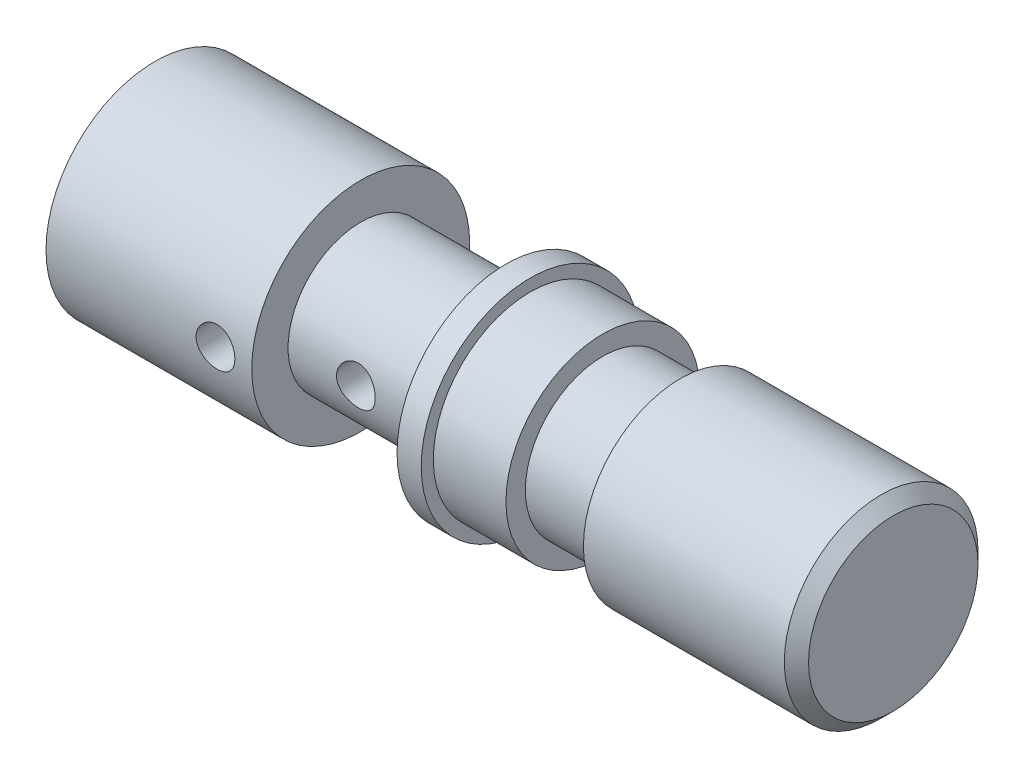
ISO-10303-21;
HEADER;
FILE_DESCRIPTION(('STEP AP214'),'2;1');
FILE_NAME('part.step','',(''),(''),'','','');
FILE_SCHEMA(('AUTOMOTIVE_DESIGN { 1 0 10303 214 1 1 1 1 }'));
ENDSEC;
DATA;
#1=APPLICATION_CONTEXT('core data for automotive mechanical design processes');
#2=APPLICATION_PROTOCOL_DEFINITION('international standard','automotive_design',2000,#1);
#3=PRODUCT_CONTEXT('',#1,'mechanical');
#4=PRODUCT('Part','Part','',(#3));
#5=PRODUCT_RELATED_PRODUCT_CATEGORY('part','',(#4));
#6=PRODUCT_DEFINITION_FORMATION('','',#4);
#7=PRODUCT_DEFINITION_CONTEXT('part definition',#1,'design');
#8=PRODUCT_DEFINITION('design','',#6,#7);
#9=PRODUCT_DEFINITION_SHAPE('','',#8);
#10=(LENGTH_UNIT() NAMED_UNIT(*) SI_UNIT(.MILLI.,.METRE.));
#11=(NAMED_UNIT(*) PLANE_ANGLE_UNIT() SI_UNIT($,.RADIAN.));
#12=(NAMED_UNIT(*) SI_UNIT($,.STERADIAN.) SOLID_ANGLE_UNIT());
#13=UNCERTAINTY_MEASURE_WITH_UNIT(LENGTH_MEASURE(1.E-05),#10,'distance_accuracy_value','');
#14=(GEOMETRIC_REPRESENTATION_CONTEXT(3) GLOBAL_UNCERTAINTY_ASSIGNED_CONTEXT((#13)) GLOBAL_UNIT_ASSIGNED_CONTEXT((#10,
#11,#12)) REPRESENTATION_CONTEXT('',''));
#15=CARTESIAN_POINT('',(0.,0.,0.));
#16=DIRECTION('',(0.,0.,1.));
#17=DIRECTION('',(1.,0.,0.));
#18=AXIS2_PLACEMENT_3D('',#15,#16,#17);
#19=CARTESIAN_POINT('',(8.5,0.,0.));
#20=DIRECTION('',(1.,0.,0.));
#21=DIRECTION('',(0.,0.,-1.));
#22=AXIS2_PLACEMENT_3D('',#19,#20,#21);
#23=CYLINDRICAL_SURFACE('',#22,3.);
#24=CARTESIAN_POINT('',(10.5,0.,3.));
#25=CARTESIAN_POINT('',(10.5000010467739,0.0441018223331418,2.99999933524065));
#26=CARTESIAN_POINT('',(10.5036590456759,0.0882148640887363,2.99901794464862));
#27=CARTESIAN_POINT('',(10.5181684922955,0.175170180541786,2.99519829448663));
#28=CARTESIAN_POINT('',(10.5290234017704,0.218011833327635,2.9923591413303));
#29=CARTESIAN_POINT('',(10.5575486667456,0.301156635618126,2.98513733301121));
#30=CARTESIAN_POINT('',(10.5752102350664,0.341462980406115,2.98075666852169));
#31=CARTESIAN_POINT('',(10.6168148970666,0.418541474557063,2.97091479660652));
#32=CARTESIAN_POINT('',(10.6407584093437,0.455313388179848,2.96545351718002));
#33=CARTESIAN_POINT('',(10.6948334065654,0.52513180149601,2.95389845960869));
#34=CARTESIAN_POINT('',(10.7250834672034,0.558084675945127,2.9477938707174));
#35=CARTESIAN_POINT('',(10.7906593932253,0.618514854642541,2.93570963871569));
#36=CARTESIAN_POINT('',(10.8259859110467,0.645991453982617,2.92973001177899));
#37=CARTESIAN_POINT('',(10.9014592939305,0.695145636973703,2.91846214986765));
#38=CARTESIAN_POINT('',(10.9416785313059,0.71671551094611,2.91318755429117));
#39=CARTESIAN_POINT('',(11.0253360444358,0.752750192307818,2.90408590923454));
#40=CARTESIAN_POINT('',(11.0687737249281,0.767216309804882,2.9002585928704));
#41=CARTESIAN_POINT('',(11.1565982151307,0.788307680905702,2.89459646334927));
#42=CARTESIAN_POINT('',(11.2009414159809,0.795102680979746,2.89271859176123));
#43=CARTESIAN_POINT('',(11.2901750733332,0.801188138824371,2.89103932417876));
#44=CARTESIAN_POINT('',(11.3350654260142,0.800479998822944,2.89123754019361));
#45=CARTESIAN_POINT('',(11.422794166149,0.791714040010485,2.89364951507618));
#46=CARTESIAN_POINT('',(11.4656548728152,0.783861624258975,2.89580694201076));
#47=CARTESIAN_POINT('',(11.5494273337827,0.761358994888816,2.90180405235812));
#48=CARTESIAN_POINT('',(11.5903389320302,0.746708237972002,2.90564387021998));
#49=CARTESIAN_POINT('',(11.6695872575234,0.710857427861002,2.91462264698391));
#50=CARTESIAN_POINT('',(11.7078897357145,0.689585364551133,2.91977577127223));
#51=CARTESIAN_POINT('',(11.7804536635406,0.641146015295118,2.93079291857236));
#52=CARTESIAN_POINT('',(11.8147143156626,0.613977568897009,2.93665708142145));
#53=CARTESIAN_POINT('',(11.8793955989819,0.553466429053675,2.94867004251873));
#54=CARTESIAN_POINT('',(11.909654527326,0.519951250913197,2.95482188595513));
#55=CARTESIAN_POINT('',(11.9641555121401,0.44824706728255,2.96654552510546));
#56=CARTESIAN_POINT('',(11.988397331481,0.410057877682036,2.97211729795427));
#57=CARTESIAN_POINT('',(12.0302471611299,0.32983930219898,2.98208728159312));
#58=CARTESIAN_POINT('',(12.0478259081794,0.287793961020715,2.98648029133423));
#59=CARTESIAN_POINT('',(12.0756188755254,0.201200917756158,2.99356017760401));
#60=CARTESIAN_POINT('',(12.0858347050896,0.156653764771329,2.996247426935));
#61=CARTESIAN_POINT('',(12.0983579507671,0.0677016332582057,2.99955663423354));
#62=CARTESIAN_POINT('',(12.1008852159403,0.0233296950565514,3.00023598988385));
#63=CARTESIAN_POINT('',(12.0985667343012,-0.0652040183604797,2.99961788676677));
#64=CARTESIAN_POINT('',(12.0937217495577,-0.109365814824845,2.99832063232137));
#65=CARTESIAN_POINT('',(12.076976621016,-0.195440979960713,2.99393214198412));
#66=CARTESIAN_POINT('',(12.0651991015209,-0.237379940811116,2.99087210618547));
#67=CARTESIAN_POINT('',(12.0350656221968,-0.318682788470423,2.98330517957641));
#68=CARTESIAN_POINT('',(12.0167089494998,-0.358046395686399,2.9787981319841));
#69=CARTESIAN_POINT('',(11.9735304451277,-0.433935389867193,2.96870264223867));
#70=CARTESIAN_POINT('',(11.9485890132808,-0.47039007538452,2.96309474642193));
#71=CARTESIAN_POINT('',(11.8930993479369,-0.538673854158812,2.95144580946015));
#72=CARTESIAN_POINT('',(11.8625500069601,-0.570502031519497,2.94540468290222));
#73=CARTESIAN_POINT('',(11.7956857690017,-0.629555697915276,2.9333589834749));
#74=CARTESIAN_POINT('',(11.7592325754399,-0.656626076999944,2.92736024574782));
#75=CARTESIAN_POINT('',(11.6821741215621,-0.704268764739795,2.91626578870035));
#76=CARTESIAN_POINT('',(11.6415690345585,-0.724841344486108,2.91117003171109));
#77=CARTESIAN_POINT('',(11.5575618771647,-0.758749646345945,2.9025170736066));
#78=CARTESIAN_POINT('',(11.5141776752508,-0.77212724902359,2.89895099369493));
#79=CARTESIAN_POINT('',(11.4256642721065,-0.791364820483173,2.89375930092876));
#80=CARTESIAN_POINT('',(11.3805355198532,-0.797226710411953,2.89213319219128));
#81=CARTESIAN_POINT('',(11.291402084851,-0.801155958613013,2.89104697818674));
#82=CARTESIAN_POINT('',(11.2474090718979,-0.799472622471941,2.89151759094413));
#83=CARTESIAN_POINT('',(11.1603585943948,-0.78893750400225,2.89440958435318));
#84=CARTESIAN_POINT('',(11.1173011057994,-0.780085906140234,2.89683091480545));
#85=CARTESIAN_POINT('',(11.0336576991484,-0.755610062798667,2.903310284285));
#86=CARTESIAN_POINT('',(10.9930552629072,-0.740038644302285,2.90735554007653));
#87=CARTESIAN_POINT('',(10.9150084677863,-0.702606218249579,2.91662727254676));
#88=CARTESIAN_POINT('',(10.8775646054798,-0.680744224098476,2.92185393448601));
#89=CARTESIAN_POINT('',(10.8057078562014,-0.630595637075257,2.93309168576127));
#90=CARTESIAN_POINT('',(10.7714165860095,-0.602138919071634,2.93912133240661));
#91=CARTESIAN_POINT('',(10.7080150193331,-0.539932214044402,2.95118201513218));
#92=CARTESIAN_POINT('',(10.6789059845325,-0.506180941743499,2.95721305119381));
#93=CARTESIAN_POINT('',(10.6260831049413,-0.433471992435474,2.96875124961583));
#94=CARTESIAN_POINT('',(10.6024979957403,-0.394418384700712,2.97424444525819));
#95=CARTESIAN_POINT('',(10.5622650336283,-0.312755456166756,2.9839352404116));
#96=CARTESIAN_POINT('',(10.5456127297346,-0.270148437878519,2.98813367073438));
#97=CARTESIAN_POINT('',(10.5218898858338,-0.189749881952397,2.99421901005387));
#98=CARTESIAN_POINT('',(10.513700246563,-0.152304806626015,2.99637108237041));
#99=CARTESIAN_POINT('',(10.5027551175332,-0.0765759181268307,2.99926179614582));
#100=CARTESIAN_POINT('',(10.49999909112,-0.0382921881619442,3.00000057718908));
#101=CARTESIAN_POINT('',(10.5,0.,3.));
#102=B_SPLINE_CURVE_WITH_KNOTS('',3,(#24,#25,#26,#27,#28,#29,#30,#31,#32,#33,#34,#35,#36,#37,
#38,#39,#40,#41,#42,#43,#44,#45,#46,#47,#48,#49,#50,#51,#52,#53,#54,#55,#56,#57,#58,#59,#60,#61,
#62,#63,#64,#65,#66,#67,#68,#69,#70,#71,#72,#73,#74,#75,#76,#77,#78,#79,#80,#81,#82,#83,#84,#85,
#86,#87,#88,#89,#90,#91,#92,#93,#94,#95,#96,#97,#98,#99,#100,#101),.UNSPECIFIED.,.T.,.F.,(4,2,2,
2,2,2,2,2,2,2,2,2,2,2,2,2,2,2,2,2,2,2,2,2,2,2,2,2,2,2,2,2,2,2,2,2,2,2,4),(0.,0.132165039579828,
0.26439369750458,0.396452221188773,0.528519546834702,0.663339591819869,0.798176979700597,
0.935330330092918,1.0724583765188,1.20648863299036,1.34049384159394,1.47076400816065,
1.60104458722842,1.73279469336265,1.86457075244718,2.00064503922595,2.13672468772705,
2.27339523838883,2.41003590873722,2.54273087007485,2.67541211567806,2.80581414254512,
2.93623030307912,3.06920114399486,3.20219827301221,3.33894598550782,3.47568799207309,
3.61162519076595,3.74752763461531,3.87897336957382,4.01041572204175,4.14084306175259,
4.27129086845139,4.40557735824494,4.53989649728917,4.67708900908297,4.8141933045401,
4.92895927593272,5.04371391182491),.UNSPECIFIED.);
#103=CARTESIAN_POINT('',(10.5,0.,3.));
#104=VERTEX_POINT('',#103);
#105=EDGE_CURVE('E80',#104,#104,#102,.T.);
#106=ORIENTED_EDGE('',*,*,#105,.T.);
#107=EDGE_LOOP('',(#106));
#108=FACE_BOUND('',#107,.T.);
#109=CARTESIAN_POINT('',(8.5,0.,0.));
#110=DIRECTION('',(1.,0.,0.));
#111=DIRECTION('',(0.,0.,-1.));
#112=AXIS2_PLACEMENT_3D('',#109,#110,#111);
#113=CIRCLE('',#112,3.);
#114=CARTESIAN_POINT('',(8.5,0.,-3.));
#115=VERTEX_POINT('',#114);
#116=EDGE_CURVE('E127',#115,#115,#113,.T.);
#117=ORIENTED_EDGE('',*,*,#116,.T.);
#118=EDGE_LOOP('',(#117));
#119=FACE_BOUND('',#118,.T.);
#120=CARTESIAN_POINT('',(14.5,0.,0.));
#121=DIRECTION('',(1.,0.,0.));
#122=DIRECTION('',(0.,0.,-1.));
#123=AXIS2_PLACEMENT_3D('',#120,#121,#122);
#124=CIRCLE('',#123,3.);
#125=CARTESIAN_POINT('',(14.5,0.,-3.));
#126=VERTEX_POINT('',#125);
#127=EDGE_CURVE('E131',#126,#126,#124,.T.);
#128=ORIENTED_EDGE('',*,*,#127,.F.);
#129=EDGE_LOOP('',(#128));
#130=FACE_BOUND('',#129,.T.);
#131=CARTESIAN_POINT('',(10.5,0.,-3.));
#132=CARTESIAN_POINT('',(10.5000010467739,-0.0441018223331418,-2.99999933524065));
#133=CARTESIAN_POINT('',(10.5036590456759,-0.0882148640887363,-2.99901794464862));
#134=CARTESIAN_POINT('',(10.5181684922955,-0.175170180541786,-2.99519829448663));
#135=CARTESIAN_POINT('',(10.5290234017704,-0.218011833327635,-2.9923591413303));
#136=CARTESIAN_POINT('',(10.5575486667456,-0.301156635618126,-2.98513733301121));
#137=CARTESIAN_POINT('',(10.5752102350664,-0.341462980406115,-2.98075666852169));
#138=CARTESIAN_POINT('',(10.6168148970666,-0.418541474557063,-2.97091479660652));
#139=CARTESIAN_POINT('',(10.6407584093437,-0.455313388179848,-2.96545351718002));
#140=CARTESIAN_POINT('',(10.6948334065654,-0.52513180149601,-2.95389845960869));
#141=CARTESIAN_POINT('',(10.7250834672034,-0.558084675945127,-2.9477938707174));
#142=CARTESIAN_POINT('',(10.7906593932253,-0.618514854642541,-2.93570963871569));
#143=CARTESIAN_POINT('',(10.8259859110467,-0.645991453982617,-2.92973001177899));
#144=CARTESIAN_POINT('',(10.9014592939305,-0.695145636973703,-2.91846214986765));
#145=CARTESIAN_POINT('',(10.9416785313059,-0.71671551094611,-2.91318755429117));
#146=CARTESIAN_POINT('',(11.0253360444358,-0.752750192307818,-2.90408590923454));
#147=CARTESIAN_POINT('',(11.0687737249281,-0.767216309804882,-2.9002585928704));
#148=CARTESIAN_POINT('',(11.1565982151307,-0.788307680905702,-2.89459646334927));
#149=CARTESIAN_POINT('',(11.2009414159809,-0.795102680979746,-2.89271859176123));
#150=CARTESIAN_POINT('',(11.2901750733332,-0.801188138824371,-2.89103932417876));
#151=CARTESIAN_POINT('',(11.3350654260142,-0.800479998822944,-2.89123754019361));
#152=CARTESIAN_POINT('',(11.422794166149,-0.791714040010485,-2.89364951507618));
#153=CARTESIAN_POINT('',(11.4656548728152,-0.783861624258975,-2.89580694201076));
#154=CARTESIAN_POINT('',(11.5494273337827,-0.761358994888816,-2.90180405235812));
#155=CARTESIAN_POINT('',(11.5903389320302,-0.746708237972002,-2.90564387021998));
#156=CARTESIAN_POINT('',(11.6695872575234,-0.710857427861002,-2.91462264698391));
#157=CARTESIAN_POINT('',(11.7078897357145,-0.689585364551133,-2.91977577127223));
#158=CARTESIAN_POINT('',(11.7804536635406,-0.641146015295118,-2.93079291857236));
#159=CARTESIAN_POINT('',(11.8147143156626,-0.613977568897009,-2.93665708142145));
#160=CARTESIAN_POINT('',(11.8793955989819,-0.553466429053675,-2.94867004251873));
#161=CARTESIAN_POINT('',(11.909654527326,-0.519951250913197,-2.95482188595513));
#162=CARTESIAN_POINT('',(11.9641555121401,-0.44824706728255,-2.96654552510546));
#163=CARTESIAN_POINT('',(11.988397331481,-0.410057877682036,-2.97211729795427));
#164=CARTESIAN_POINT('',(12.0302471611299,-0.32983930219898,-2.98208728159312));
#165=CARTESIAN_POINT('',(12.0478259081794,-0.287793961020715,-2.98648029133423));
#166=CARTESIAN_POINT('',(12.0756188755254,-0.201200917756158,-2.99356017760401));
#167=CARTESIAN_POINT('',(12.0858347050896,-0.156653764771329,-2.996247426935));
#168=CARTESIAN_POINT('',(12.0983579507671,-0.0677016332582057,-2.99955663423354));
#169=CARTESIAN_POINT('',(12.1008852159403,-0.0233296950565514,-3.00023598988385));
#170=CARTESIAN_POINT('',(12.0985667343012,0.0652040183604797,-2.99961788676677));
#171=CARTESIAN_POINT('',(12.0937217495577,0.109365814824845,-2.99832063232137));
#172=CARTESIAN_POINT('',(12.076976621016,0.195440979960713,-2.99393214198412));
#173=CARTESIAN_POINT('',(12.0651991015209,0.237379940811116,-2.99087210618547));
#174=CARTESIAN_POINT('',(12.0350656221968,0.318682788470423,-2.98330517957641));
#175=CARTESIAN_POINT('',(12.0167089494998,0.358046395686399,-2.9787981319841));
#176=CARTESIAN_POINT('',(11.9735304451277,0.433935389867193,-2.96870264223867));
#177=CARTESIAN_POINT('',(11.9485890132808,0.47039007538452,-2.96309474642193));
#178=CARTESIAN_POINT('',(11.8930993479369,0.538673854158812,-2.95144580946015));
#179=CARTESIAN_POINT('',(11.8625500069601,0.570502031519497,-2.94540468290222));
#180=CARTESIAN_POINT('',(11.7956857690017,0.629555697915276,-2.9333589834749));
#181=CARTESIAN_POINT('',(11.7592325754399,0.656626076999944,-2.92736024574782));
#182=CARTESIAN_POINT('',(11.6821741215621,0.704268764739795,-2.91626578870035));
#183=CARTESIAN_POINT('',(11.6415690345585,0.724841344486108,-2.91117003171109));
#184=CARTESIAN_POINT('',(11.5575618771647,0.758749646345945,-2.9025170736066));
#185=CARTESIAN_POINT('',(11.5141776752508,0.77212724902359,-2.89895099369493));
#186=CARTESIAN_POINT('',(11.4256642721065,0.791364820483173,-2.89375930092876));
#187=CARTESIAN_POINT('',(11.3805355198532,0.797226710411953,-2.89213319219128));
#188=CARTESIAN_POINT('',(11.291402084851,0.801155958613013,-2.89104697818674));
#189=CARTESIAN_POINT('',(11.2474090718979,0.799472622471941,-2.89151759094413));
#190=CARTESIAN_POINT('',(11.1603585943948,0.78893750400225,-2.89440958435318));
#191=CARTESIAN_POINT('',(11.1173011057994,0.780085906140234,-2.89683091480545));
#192=CARTESIAN_POINT('',(11.0336576991484,0.755610062798667,-2.903310284285));
#193=CARTESIAN_POINT('',(10.9930552629072,0.740038644302285,-2.90735554007653));
#194=CARTESIAN_POINT('',(10.9150084677863,0.702606218249579,-2.91662727254676));
#195=CARTESIAN_POINT('',(10.8775646054798,0.680744224098476,-2.92185393448601));
#196=CARTESIAN_POINT('',(10.8057078562014,0.630595637075257,-2.93309168576127));
#197=CARTESIAN_POINT('',(10.7714165860095,0.602138919071634,-2.93912133240661));
#198=CARTESIAN_POINT('',(10.7080150193331,0.539932214044402,-2.95118201513218));
#199=CARTESIAN_POINT('',(10.6789059845325,0.506180941743499,-2.95721305119381));
#200=CARTESIAN_POINT('',(10.6260831049413,0.433471992435474,-2.96875124961583));
#201=CARTESIAN_POINT('',(10.6024979957403,0.394418384700712,-2.97424444525819));
#202=CARTESIAN_POINT('',(10.5622650336283,0.312755456166756,-2.9839352404116));
#203=CARTESIAN_POINT('',(10.5456127297346,0.270148437878519,-2.98813367073438));
#204=CARTESIAN_POINT('',(10.5218898858338,0.189749881952397,-2.99421901005387));
#205=CARTESIAN_POINT('',(10.513700246563,0.152304806626015,-2.99637108237041));
#206=CARTESIAN_POINT('',(10.5027551175332,0.0765759181268307,-2.99926179614582));
#207=CARTESIAN_POINT('',(10.49999909112,0.0382921881619442,-3.00000057718908));
#208=CARTESIAN_POINT('',(10.5,0.,-3.));
#209=B_SPLINE_CURVE_WITH_KNOTS('',3,(#131,#132,#133,#134,#135,#136,#137,#138,#139,#140,#141,
#142,#143,#144,#145,#146,#147,#148,#149,#150,#151,#152,#153,#154,#155,#156,#157,#158,#159,#160,
#161,#162,#163,#164,#165,#166,#167,#168,#169,#170,#171,#172,#173,#174,#175,#176,#177,#178,#179,
#180,#181,#182,#183,#184,#185,#186,#187,#188,#189,#190,#191,#192,#193,#194,#195,#196,#197,#198,
#199,#200,#201,#202,#203,#204,#205,#206,#207,#208),.UNSPECIFIED.,.T.,.F.,(4,2,2,2,2,2,2,2,2,2,2,
2,2,2,2,2,2,2,2,2,2,2,2,2,2,2,2,2,2,2,2,2,2,2,2,2,2,2,4),(0.,0.132165039579828,0.26439369750458,
0.396452221188773,0.528519546834702,0.663339591819869,0.798176979700597,0.935330330092918,
1.0724583765188,1.20648863299036,1.34049384159394,1.47076400816065,1.60104458722842,
1.73279469336265,1.86457075244718,2.00064503922595,2.13672468772705,2.27339523838883,
2.41003590873722,2.54273087007485,2.67541211567806,2.80581414254512,2.93623030307912,
3.06920114399486,3.20219827301221,3.33894598550782,3.47568799207309,3.61162519076595,
3.74752763461531,3.87897336957382,4.01041572204175,4.14084306175259,4.27129086845139,
4.40557735824494,4.53989649728917,4.67708900908297,4.8141933045401,4.92895927593272,
5.04371391182491),.UNSPECIFIED.);
#210=CARTESIAN_POINT('',(10.5,0.,-3.));
#211=VERTEX_POINT('',#210);
#212=EDGE_CURVE('E41',#211,#211,#209,.T.);
#213=ORIENTED_EDGE('',*,*,#212,.T.);
#214=EDGE_LOOP('',(#213));
#215=FACE_BOUND('',#214,.T.);
#216=ADVANCED_FACE('F37',(#108,#119,#130,#215),#23,.T.);
#217=CARTESIAN_POINT('',(30.5,0.,0.));
#218=DIRECTION('',(-1.,0.,0.));
#219=DIRECTION('',(0.,0.,1.));
#220=AXIS2_PLACEMENT_3D('',#217,#218,#219);
#221=CYLINDRICAL_SURFACE('',#220,4.);
#222=CARTESIAN_POINT('',(15.5,0.,0.));
#223=DIRECTION('',(1.,0.,0.));
#224=DIRECTION('',(0.,0.,-1.));
#225=AXIS2_PLACEMENT_3D('',#222,#223,#224);
#226=CIRCLE('',#225,4.);
#227=CARTESIAN_POINT('',(15.5,0.,-4.));
#228=VERTEX_POINT('',#227);
#229=EDGE_CURVE('E70',#228,#228,#226,.T.);
#230=ORIENTED_EDGE('',*,*,#229,.T.);
#231=EDGE_LOOP('',(#230));
#232=FACE_BOUND('',#231,.T.);
#233=CARTESIAN_POINT('',(18.5,0.,0.));
#234=DIRECTION('',(-1.,0.,0.));
#235=DIRECTION('',(0.,0.,1.));
#236=AXIS2_PLACEMENT_3D('',#233,#234,#235);
#237=CIRCLE('',#236,4.);
#238=CARTESIAN_POINT('',(18.5,0.,4.));
#239=VERTEX_POINT('',#238);
#240=EDGE_CURVE('E144',#239,#239,#237,.T.);
#241=ORIENTED_EDGE('',*,*,#240,.T.);
#242=EDGE_LOOP('',(#241));
#243=FACE_BOUND('',#242,.T.);
#244=ADVANCED_FACE('F114',(#232,#243),#221,.T.);
#245=CARTESIAN_POINT('',(0.,0.,0.));
#246=DIRECTION('',(-1.,0.,0.));
#247=DIRECTION('',(0.,0.,1.));
#248=AXIS2_PLACEMENT_3D('',#245,#246,#247);
#249=CYLINDRICAL_SURFACE('',#248,4.5);
#250=CARTESIAN_POINT('',(0.,0.,0.));
#251=DIRECTION('',(-1.,0.,0.));
#252=DIRECTION('',(0.,0.,1.));
#253=AXIS2_PLACEMENT_3D('',#250,#251,#252);
#254=CIRCLE('',#253,4.5);
#255=CARTESIAN_POINT('',(0.,0.,4.5));
#256=VERTEX_POINT('',#255);
#257=EDGE_CURVE('E79',#256,#256,#254,.F.);
#258=ORIENTED_EDGE('',*,*,#257,.T.);
#259=EDGE_LOOP('',(#258));
#260=FACE_BOUND('',#259,.T.);
#261=CARTESIAN_POINT('',(7.79999999999999,0.,4.5));
#262=CARTESIAN_POINT('',(7.79999669285109,-0.0445302019902762,4.4999987251344));
#263=CARTESIAN_POINT('',(7.79626829303965,-0.0890912596016622,4.49933191579469));
#264=CARTESIAN_POINT('',(7.78144879324272,-0.177007998173705,4.49673340269843));
#265=CARTESIAN_POINT('',(7.77034286477667,-0.220361067906401,4.49479915155094));
#266=CARTESIAN_POINT('',(7.74111710927269,-0.304509156285261,4.48988288235168));
#267=CARTESIAN_POINT('',(7.72300639166933,-0.345307417615937,4.48690222556947));
#268=CARTESIAN_POINT('',(7.68030672701908,-0.423270679076012,4.48022037355359));
#269=CARTESIAN_POINT('',(7.65572010829142,-0.460436978455032,4.47651943741086));
#270=CARTESIAN_POINT('',(7.60047877611666,-0.530504265335136,4.46876063676479));
#271=CARTESIAN_POINT('',(7.56976700195238,-0.563359923831297,4.4646996321084));
#272=CARTESIAN_POINT('',(7.5032684987993,-0.623482447413518,4.45670189389839));
#273=CARTESIAN_POINT('',(7.46748116310341,-0.650748643409126,4.45276517527017));
#274=CARTESIAN_POINT('',(7.39153678043565,-0.699098854699203,4.44543193381378));
#275=CARTESIAN_POINT('',(7.35135074319269,-0.720137994078746,4.44203940925614));
#276=CARTESIAN_POINT('',(7.26794467859312,-0.755149496760371,4.43622206592378));
#277=CARTESIAN_POINT('',(7.22472491184272,-0.76912246622308,4.43379716414679));
#278=CARTESIAN_POINT('',(7.1369555532383,-0.789462618013184,4.43022069031475));
#279=CARTESIAN_POINT('',(7.09242453633102,-0.795907619183619,4.42905609946288));
#280=CARTESIAN_POINT('',(7.00289904214776,-0.801250298943398,4.42809279794646));
#281=CARTESIAN_POINT('',(6.95790460172938,-0.800148573190807,4.42829397948242));
#282=CARTESIAN_POINT('',(6.86928974852928,-0.790492328815567,4.43002761926745));
#283=CARTESIAN_POINT('',(6.82565938976431,-0.78202584632061,4.43154435119883));
#284=CARTESIAN_POINT('',(6.74044806531323,-0.758018717801775,4.43571355320595));
#285=CARTESIAN_POINT('',(6.69886719520686,-0.742477742197876,4.43836607619453));
#286=CARTESIAN_POINT('',(6.61867383725183,-0.704674571030506,4.44452479180617));
#287=CARTESIAN_POINT('',(6.58007880182158,-0.682376130457592,4.44803556770488));
#288=CARTESIAN_POINT('',(6.50714789701056,-0.631718577196265,4.45551176477343));
#289=CARTESIAN_POINT('',(6.47281209365784,-0.603359370570387,4.4594771929896));
#290=CARTESIAN_POINT('',(6.40886771793728,-0.540913471370295,4.46748420457096));
#291=CARTESIAN_POINT('',(6.37933178964776,-0.506752384055842,4.47152607851284));
#292=CARTESIAN_POINT('',(6.326386651499,-0.433904432458158,4.47918142153678));
#293=CARTESIAN_POINT('',(6.30298016590248,-0.395215566796148,4.48279469973826));
#294=CARTESIAN_POINT('',(6.26295045725625,-0.314323038266952,4.48919253673555));
#295=CARTESIAN_POINT('',(6.24633976044161,-0.272113055955517,4.49197556264818));
#296=CARTESIAN_POINT('',(6.22049997014189,-0.185510818303223,4.49638248688498));
#297=CARTESIAN_POINT('',(6.21125533597136,-0.141123368220269,4.49800882476965));
#298=CARTESIAN_POINT('',(6.2019409774409,-0.0643504740757385,4.4996542087596));
#299=CARTESIAN_POINT('',(6.19999760982556,-0.0321832955709817,4.50000092138312));
#300=CARTESIAN_POINT('',(6.20000330714891,0.0445302019902751,4.4999987251344));
#301=CARTESIAN_POINT('',(6.20373170696035,0.089091259601661,4.49933191579469));
#302=CARTESIAN_POINT('',(6.21855120675728,0.177007998173704,4.49673340269843));
#303=CARTESIAN_POINT('',(6.22965713522333,0.2203610679064,4.49479915155094));
#304=CARTESIAN_POINT('',(6.25888289072731,0.30450915628526,4.48988288235168));
#305=CARTESIAN_POINT('',(6.27699360833067,0.345307417615936,4.48690222556947));
#306=CARTESIAN_POINT('',(6.31969327298092,0.423270679076011,4.48022037355359));
#307=CARTESIAN_POINT('',(6.34427989170858,0.460436978455031,4.47651943741086));
#308=CARTESIAN_POINT('',(6.39952122388334,0.530504265335135,4.46876063676479));
#309=CARTESIAN_POINT('',(6.43023299804762,0.563359923831297,4.4646996321084));
#310=CARTESIAN_POINT('',(6.4967315012007,0.623482447413518,4.45670189389839));
#311=CARTESIAN_POINT('',(6.53251883689659,0.650748643409126,4.45276517527017));
#312=CARTESIAN_POINT('',(6.60846321956435,0.699098854699203,4.44543193381378));
#313=CARTESIAN_POINT('',(6.64864925680731,0.720137994078746,4.44203940925614));
#314=CARTESIAN_POINT('',(6.73205532140688,0.755149496760371,4.43622206592378));
#315=CARTESIAN_POINT('',(6.77527508815728,0.76912246622308,4.43379716414679));
#316=CARTESIAN_POINT('',(6.8630444467617,0.789462618013184,4.43022069031475));
#317=CARTESIAN_POINT('',(6.90757546366898,0.795907619183619,4.42905609946288));
#318=CARTESIAN_POINT('',(6.99710095785224,0.801250298943398,4.42809279794646));
#319=CARTESIAN_POINT('',(7.04209539827062,0.800148573190807,4.42829397948242));
#320=CARTESIAN_POINT('',(7.13071025147072,0.790492328815567,4.43002761926745));
#321=CARTESIAN_POINT('',(7.17434061023569,0.78202584632061,4.43154435119883));
#322=CARTESIAN_POINT('',(7.25955193468677,0.758018717801775,4.43571355320595));
#323=CARTESIAN_POINT('',(7.30113280479314,0.742477742197876,4.43836607619453));
#324=CARTESIAN_POINT('',(7.38132616274817,0.704674571030507,4.44452479180617));
#325=CARTESIAN_POINT('',(7.41992119817842,0.682376130457593,4.44803556770488));
#326=CARTESIAN_POINT('',(7.49285210298943,0.631718577196266,4.45551176477343));
#327=CARTESIAN_POINT('',(7.52718790634216,0.603359370570388,4.4594771929896));
#328=CARTESIAN_POINT('',(7.59113228206272,0.540913471370296,4.46748420457096));
#329=CARTESIAN_POINT('',(7.62066821035224,0.506752384055842,4.47152607851284));
#330=CARTESIAN_POINT('',(7.673613348501,0.433904432458159,4.47918142153678));
#331=CARTESIAN_POINT('',(7.69701983409752,0.395215566796148,4.48279469973826));
#332=CARTESIAN_POINT('',(7.73704954274375,0.314323038266952,4.48919253673555));
#333=CARTESIAN_POINT('',(7.75366023955839,0.272113055955518,4.49197556264818));
#334=CARTESIAN_POINT('',(7.77950002985811,0.185510818303224,4.49638248688498));
#335=CARTESIAN_POINT('',(7.78874466402864,0.141123368220271,4.49800882476965));
#336=CARTESIAN_POINT('',(7.7980590225591,0.0643504740757397,4.4996542087596));
#337=CARTESIAN_POINT('',(7.80000239017444,0.0321832955709818,4.50000092138312));
#338=CARTESIAN_POINT('',(7.79999999999999,0.,4.5));
#339=B_SPLINE_CURVE_WITH_KNOTS('',3,(#261,#262,#263,#264,#265,#266,#267,#268,#269,#270,#271,
#272,#273,#274,#275,#276,#277,#278,#279,#280,#281,#282,#283,#284,#285,#286,#287,#288,#289,#290,
#291,#292,#293,#294,#295,#296,#297,#298,#299,#300,#301,#302,#303,#304,#305,#306,#307,#308,#309,
#310,#311,#312,#313,#314,#315,#316,#317,#318,#319,#320,#321,#322,#323,#324,#325,#326,#327,#328,
#329,#330,#331,#332,#333,#334,#335,#336,#337,#338),.UNSPECIFIED.,.T.,.F.,(4,2,2,2,2,2,2,2,2,2,2,
2,2,2,2,2,2,2,2,2,2,2,2,2,2,2,2,2,2,2,2,2,2,2,2,2,2,2,4),(0.,0.133485045984415,
0.267239205636307,0.400820005305205,0.534352843278334,0.669193219956315,0.804049728380923,
0.939855667834769,1.07564995540584,1.21002771303742,1.34439486444547,1.47717756563004,
1.60996645340695,1.74348058031323,1.87699677674146,2.01237593210316,2.14781515570268,
2.28350291290744,2.41890363672683,2.51537723211183,2.64886227809625,2.78261643774814,
2.91619723741704,3.04973007539017,3.18457045206815,3.31942696049276,3.4552328999466,
3.59102718751768,3.72540494514925,3.8597720965573,3.99255479774187,4.12534368551879,
4.25885781242506,4.39237400885329,4.52775316421499,4.66319238781452,4.79888014501927,
4.93428086883866,5.03075446422367),.UNSPECIFIED.);
#340=CARTESIAN_POINT('',(7.79999999999999,0.,4.5));
#341=VERTEX_POINT('',#340);
#342=EDGE_CURVE('E159',#341,#341,#339,.T.);
#343=ORIENTED_EDGE('',*,*,#342,.T.);
#344=EDGE_LOOP('',(#343));
#345=FACE_BOUND('',#344,.T.);
#346=CARTESIAN_POINT('',(8.5,0.,0.));
#347=DIRECTION('',(1.,0.,0.));
#348=DIRECTION('',(0.,0.,-1.));
#349=AXIS2_PLACEMENT_3D('',#346,#347,#348);
#350=CIRCLE('',#349,4.5);
#351=CARTESIAN_POINT('',(8.5,0.,-4.5));
#352=VERTEX_POINT('',#351);
#353=EDGE_CURVE('E150',#352,#352,#350,.T.);
#354=ORIENTED_EDGE('',*,*,#353,.F.);
#355=EDGE_LOOP('',(#354));
#356=FACE_BOUND('',#355,.T.);
#357=ADVANCED_FACE('F57',(#260,#345,#356),#249,.T.);
#358=CARTESIAN_POINT('',(8.98347639172544,0.,0.));
#359=DIRECTION('',(-1.,0.,0.));
#360=DIRECTION('',(0.,0.,1.));
#361=AXIS2_PLACEMENT_3D('',#358,#359,#360);
#362=CONICAL_SURFACE('',#361,1.99999999978218,1.02974425855313);
#363=CARTESIAN_POINT('',(10.1851976299859,0.,0.));
#364=VERTEX_POINT('',#363);
#365=VERTEX_LOOP('',#364);
#366=FACE_BOUND('',#365,.T.);
#367=CARTESIAN_POINT('',(8.98347639159456,0.,0.));
#368=DIRECTION('',(-1.,0.,0.));
#369=DIRECTION('',(0.,0.,1.));
#370=AXIS2_PLACEMENT_3D('',#367,#368,#369);
#371=CIRCLE('',#370,2.);
#372=CARTESIAN_POINT('',(8.98347639159456,0.,2.));
#373=VERTEX_POINT('',#372);
#374=EDGE_CURVE('E61',#373,#373,#371,.T.);
#375=ORIENTED_EDGE('',*,*,#374,.T.);
#376=EDGE_LOOP('',(#375));
#377=FACE_BOUND('',#376,.T.);
#378=ADVANCED_FACE('F53',(#366,#377),#362,.F.);
#379=CARTESIAN_POINT('',(0.,0.,0.));
#380=DIRECTION('',(-1.,0.,0.));
#381=DIRECTION('',(0.,0.,1.));
#382=AXIS2_PLACEMENT_3D('',#379,#380,#381);
#383=CYLINDRICAL_SURFACE('',#382,2.);
#384=CARTESIAN_POINT('',(6.20000000000001,0.,2.));
#385=CARTESIAN_POINT('',(6.20000250358267,-0.0430463454256178,1.99999801637871));
#386=CARTESIAN_POINT('',(6.20349124792307,-0.0861302778141796,1.99859558978085));
#387=CARTESIAN_POINT('',(6.21731274673392,-0.171046684136091,1.99312835216941));
#388=CARTESIAN_POINT('',(6.22765532360496,-0.212877271810695,1.98905972024285));
#389=CARTESIAN_POINT('',(6.25474805987111,-0.293976281642026,1.9786977680319));
#390=CARTESIAN_POINT('',(6.27148030024517,-0.333251512706941,1.97241067286646));
#391=CARTESIAN_POINT('',(6.31080013429946,-0.408416360191476,1.95822906721322));
#392=CARTESIAN_POINT('',(6.33338765225725,-0.444306020386265,1.95033457751307));
#393=CARTESIAN_POINT('',(6.38489522579953,-0.513401908278086,1.93332320847272));
#394=CARTESIAN_POINT('',(6.41404494626393,-0.546427529188688,1.92416847118108));
#395=CARTESIAN_POINT('',(6.47736267758094,-0.607272147680979,1.90584158849423));
#396=CARTESIAN_POINT('',(6.51153273911892,-0.635089007000805,1.89666943750442));
#397=CARTESIAN_POINT('',(6.5857709588402,-0.685949651699193,1.87889123187774));
#398=CARTESIAN_POINT('',(6.62603402619157,-0.708725673891934,1.87032858452446));
#399=CARTESIAN_POINT('',(6.71021394158593,-0.747101665444902,1.85533467942164));
#400=CARTESIAN_POINT('',(6.75412909427833,-0.762704942779468,1.84890243953991));
#401=CARTESIAN_POINT('',(6.84228492516819,-0.78555952796691,1.83930543147813));
#402=CARTESIAN_POINT('',(6.88642047662186,-0.79315758367895,1.83600568270219));
#403=CARTESIAN_POINT('',(6.97545398125426,-0.800869184207327,1.83265601626054));
#404=CARTESIAN_POINT('',(7.02035154897376,-0.800986406538479,1.83260450179028));
#405=CARTESIAN_POINT('',(7.10630264022629,-0.793995749967574,1.83564200010585));
#406=CARTESIAN_POINT('',(7.14740622934633,-0.787390136963277,1.838512696215));
#407=CARTESIAN_POINT('',(7.22786376832935,-0.767978767536982,1.84670474305902));
#408=CARTESIAN_POINT('',(7.26721740917061,-0.755171920754855,1.85202652475914));
#409=CARTESIAN_POINT('',(7.34400791696364,-0.723477578149543,1.86463806911454));
#410=CARTESIAN_POINT('',(7.38138920393089,-0.704471208441246,1.87196581374652));
#411=CARTESIAN_POINT('',(7.45256769860022,-0.66100156155141,1.88775280789491));
#412=CARTESIAN_POINT('',(7.48636369886288,-0.636536454550475,1.89621243644774));
#413=CARTESIAN_POINT('',(7.55215902083535,-0.580624498181068,1.91410562618437));
#414=CARTESIAN_POINT('',(7.5838184229183,-0.548784559056498,1.92356396652973));
#415=CARTESIAN_POINT('',(7.64146640970633,-0.480135787227607,1.94183677866424));
#416=CARTESIAN_POINT('',(7.66745224553756,-0.443324559824782,1.95065093697393));
#417=CARTESIAN_POINT('',(7.71346438256747,-0.364802971791354,1.96686492276655));
#418=CARTESIAN_POINT('',(7.73335842503862,-0.323008051155686,1.97423226266298));
#419=CARTESIAN_POINT('',(7.76568666556202,-0.236334282331211,1.9864666906387));
#420=CARTESIAN_POINT('',(7.77813582841788,-0.191461824119662,1.99133879149637));
#421=CARTESIAN_POINT('',(7.79105250714522,-0.121794619716824,1.99643426988218));
#422=CARTESIAN_POINT('',(7.79440241722105,-0.0975808054822113,1.99776651699371));
#423=CARTESIAN_POINT('',(7.79887686457864,-0.0489153725985632,1.99954994156214));
#424=CARTESIAN_POINT('',(7.80000142281615,-0.0244637561910477,2.00000112731585));
#425=CARTESIAN_POINT('',(7.79999749641733,0.0430463454256177,1.99999801637871));
#426=CARTESIAN_POINT('',(7.79650875207693,0.0861302778141795,1.99859558978085));
#427=CARTESIAN_POINT('',(7.78268725326608,0.171046684136091,1.99312835216941));
#428=CARTESIAN_POINT('',(7.77234467639504,0.212877271810695,1.98905972024285));
#429=CARTESIAN_POINT('',(7.74525194012889,0.293976281642026,1.9786977680319));
#430=CARTESIAN_POINT('',(7.72851969975483,0.333251512706941,1.97241067286646));
#431=CARTESIAN_POINT('',(7.68919986570054,0.408416360191476,1.95822906721322));
#432=CARTESIAN_POINT('',(7.66661234774275,0.444306020386264,1.95033457751307));
#433=CARTESIAN_POINT('',(7.61510477420047,0.513401908278085,1.93332320847272));
#434=CARTESIAN_POINT('',(7.58595505373607,0.546427529188687,1.92416847118108));
#435=CARTESIAN_POINT('',(7.52263732241907,0.607272147680978,1.90584158849423));
#436=CARTESIAN_POINT('',(7.48846726088108,0.635089007000804,1.89666943750442));
#437=CARTESIAN_POINT('',(7.4142290411598,0.685949651699193,1.87889123187774));
#438=CARTESIAN_POINT('',(7.37396597380844,0.708725673891934,1.87032858452446));
#439=CARTESIAN_POINT('',(7.28978605841407,0.747101665444902,1.85533467942164));
#440=CARTESIAN_POINT('',(7.24587090572167,0.762704942779468,1.84890243953991));
#441=CARTESIAN_POINT('',(7.15771507483181,0.78555952796691,1.83930543147813));
#442=CARTESIAN_POINT('',(7.11357952337814,0.79315758367895,1.83600568270219));
#443=CARTESIAN_POINT('',(7.02454601874575,0.800869184207327,1.83265601626054));
#444=CARTESIAN_POINT('',(6.97964845102624,0.800986406538479,1.83260450179028));
#445=CARTESIAN_POINT('',(6.89369735977372,0.793995749967575,1.83564200010585));
#446=CARTESIAN_POINT('',(6.85259377065367,0.787390136963278,1.838512696215));
#447=CARTESIAN_POINT('',(6.77213623167065,0.767978767536983,1.84670474305902));
#448=CARTESIAN_POINT('',(6.73278259082939,0.755171920754855,1.85202652475914));
#449=CARTESIAN_POINT('',(6.65599208303636,0.723477578149543,1.86463806911454));
#450=CARTESIAN_POINT('',(6.61861079606911,0.704471208441246,1.87196581374652));
#451=CARTESIAN_POINT('',(6.54743230139978,0.66100156155141,1.88775280789491));
#452=CARTESIAN_POINT('',(6.51363630113712,0.636536454550475,1.89621243644774));
#453=CARTESIAN_POINT('',(6.44784097916466,0.580624498181069,1.91410562618437));
#454=CARTESIAN_POINT('',(6.4161815770817,0.548784559056499,1.92356396652973));
#455=CARTESIAN_POINT('',(6.35853359029367,0.480135787227608,1.94183677866424));
#456=CARTESIAN_POINT('',(6.33254775446244,0.443324559824782,1.95065093697393));
#457=CARTESIAN_POINT('',(6.28653561743253,0.364802971791353,1.96686492276655));
#458=CARTESIAN_POINT('',(6.26664157496138,0.323008051155685,1.97423226266298));
#459=CARTESIAN_POINT('',(6.23431333443798,0.236334282331211,1.9864666906387));
#460=CARTESIAN_POINT('',(6.22186417158212,0.191461824119662,1.99133879149637));
#461=CARTESIAN_POINT('',(6.20894749285478,0.121794619716824,1.99643426988218));
#462=CARTESIAN_POINT('',(6.20559758277895,0.0975808054822112,1.99776651699371));
#463=CARTESIAN_POINT('',(6.20112313542136,0.048915372598563,1.99954994156214));
#464=CARTESIAN_POINT('',(6.19999857718385,0.0244637561910475,2.00000112731585));
#465=CARTESIAN_POINT('',(6.20000000000001,0.,2.));
#466=B_SPLINE_CURVE_WITH_KNOTS('',3,(#384,#385,#386,#387,#388,#389,#390,#391,#392,#393,#394,
#395,#396,#397,#398,#399,#400,#401,#402,#403,#404,#405,#406,#407,#408,#409,#410,#411,#412,#413,
#414,#415,#416,#417,#418,#419,#420,#421,#422,#423,#424,#425,#426,#427,#428,#429,#430,#431,#432,
#433,#434,#435,#436,#437,#438,#439,#440,#441,#442,#443,#444,#445,#446,#447,#448,#449,#450,#451,
#452,#453,#454,#455,#456,#457,#458,#459,#460,#461,#462,#463,#464,#465),.UNSPECIFIED.,.T.,.F.,(4,
2,2,2,2,2,2,2,2,2,2,2,2,2,2,2,2,2,2,2,2,2,2,2,2,2,2,2,2,2,2,2,2,2,2,2,2,2,2,2,4),(0.,
0.129044055029331,0.258273447461767,0.38714306227624,0.516011010588152,0.65039477040042,
0.784833576064561,0.925260046293767,1.0656216885725,1.19961639060432,1.33354522145915,
1.45815322443322,1.58278314513644,1.70995906695789,1.83717768354603,1.97421390048658,
2.11131636560643,2.25121318095065,2.39082783897494,2.46416581917615,2.53750310876318,
2.66654716379251,2.79577655622494,2.92464617103942,3.05351411935133,3.1878978791636,
3.32233668482774,3.46276315505694,3.60312479733568,3.73711949936749,3.87104833022233,
3.9956563331964,4.12028625389962,4.24746217572107,4.37468079230921,4.51171700924975,
4.6488194743696,4.78871628971383,4.92833094773812,5.00166892793933,5.07500621752636),.UNSPECIFIED.);
#467=CARTESIAN_POINT('',(6.20000000000001,0.,2.));
#468=VERTEX_POINT('',#467);
#469=EDGE_CURVE('E63',#468,#468,#466,.T.);
#470=ORIENTED_EDGE('',*,*,#469,.T.);
#471=EDGE_LOOP('',(#470));
#472=FACE_BOUND('',#471,.T.);
#473=ORIENTED_EDGE('',*,*,#374,.F.);
#474=EDGE_LOOP('',(#473));
#475=FACE_BOUND('',#474,.T.);
#476=CARTESIAN_POINT('',(0.,0.,0.));
#477=DIRECTION('',(-1.,0.,0.));
#478=DIRECTION('',(0.,0.,1.));
#479=AXIS2_PLACEMENT_3D('',#476,#477,#478);
#480=CIRCLE('',#479,2.);
#481=CARTESIAN_POINT('',(0.,0.,2.));
#482=VERTEX_POINT('',#481);
#483=EDGE_CURVE('E67',#482,#482,#480,.T.);
#484=ORIENTED_EDGE('',*,*,#483,.T.);
#485=EDGE_LOOP('',(#484));
#486=FACE_BOUND('',#485,.T.);
#487=ADVANCED_FACE('F56',(#472,#475,#486),#383,.F.);
#488=CARTESIAN_POINT('',(7.,0.,0.));
#489=DIRECTION('',(0.,0.,-1.));
#490=DIRECTION('',(-1.,0.,0.));
#491=AXIS2_PLACEMENT_3D('',#488,#489,#490);
#492=CYLINDRICAL_SURFACE('',#491,0.799999999999993);
#493=ORIENTED_EDGE('',*,*,#469,.F.);
#494=EDGE_LOOP('',(#493));
#495=FACE_BOUND('',#494,.T.);
#496=ORIENTED_EDGE('',*,*,#342,.F.);
#497=EDGE_LOOP('',(#496));
#498=FACE_BOUND('',#497,.T.);
#499=ADVANCED_FACE('F163',(#495,#498),#492,.F.);
#500=CARTESIAN_POINT('',(0.,4.5,0.));
#501=DIRECTION('',(1.,0.,0.));
#502=DIRECTION('',(0.,0.,-1.));
#503=AXIS2_PLACEMENT_3D('',#500,#501,#502);
#504=PLANE('',#503);
#505=ORIENTED_EDGE('',*,*,#257,.F.);
#506=EDGE_LOOP('',(#505));
#507=FACE_BOUND('',#506,.T.);
#508=ORIENTED_EDGE('',*,*,#483,.F.);
#509=EDGE_LOOP('',(#508));
#510=FACE_BOUND('',#509,.T.);
#511=ADVANCED_FACE('F168',(#507,#510),#504,.F.);
#512=CARTESIAN_POINT('',(8.5,0.,0.));
#513=DIRECTION('',(1.,0.,0.));
#514=DIRECTION('',(0.,0.,-1.));
#515=AXIS2_PLACEMENT_3D('',#512,#513,#514);
#516=PLANE('',#515);
#517=ORIENTED_EDGE('',*,*,#116,.F.);
#518=EDGE_LOOP('',(#517));
#519=FACE_BOUND('',#518,.T.);
#520=ORIENTED_EDGE('',*,*,#353,.T.);
#521=EDGE_LOOP('',(#520));
#522=FACE_BOUND('',#521,.T.);
#523=ADVANCED_FACE('F58',(#519,#522),#516,.T.);
#524=CARTESIAN_POINT('',(14.5,0.,0.));
#525=DIRECTION('',(1.,0.,0.));
#526=DIRECTION('',(0.,0.,-1.));
#527=AXIS2_PLACEMENT_3D('',#524,#525,#526);
#528=PLANE('',#527);
#529=ORIENTED_EDGE('',*,*,#127,.T.);
#530=EDGE_LOOP('',(#529));
#531=FACE_BOUND('',#530,.T.);
#532=CARTESIAN_POINT('',(14.5,0.,0.));
#533=DIRECTION('',(1.,0.,0.));
#534=DIRECTION('',(0.,0.,-1.));
#535=AXIS2_PLACEMENT_3D('',#532,#533,#534);
#536=CIRCLE('',#535,4.5);
#537=CARTESIAN_POINT('',(14.5,0.,-4.5));
#538=VERTEX_POINT('',#537);
#539=EDGE_CURVE('E148',#538,#538,#536,.T.);
#540=ORIENTED_EDGE('',*,*,#539,.F.);
#541=EDGE_LOOP('',(#540));
#542=FACE_BOUND('',#541,.T.);
#543=ADVANCED_FACE('F175',(#531,#542),#528,.F.);
#544=CARTESIAN_POINT('',(15.5,0.,0.));
#545=DIRECTION('',(1.,0.,0.));
#546=DIRECTION('',(0.,0.,-1.));
#547=AXIS2_PLACEMENT_3D('',#544,#545,#546);
#548=PLANE('',#547);
#549=CARTESIAN_POINT('',(15.5,0.,0.));
#550=DIRECTION('',(1.,0.,0.));
#551=DIRECTION('',(0.,0.,-1.));
#552=AXIS2_PLACEMENT_3D('',#549,#550,#551);
#553=CIRCLE('',#552,4.5);
#554=CARTESIAN_POINT('',(15.5,0.,-4.5));
#555=VERTEX_POINT('',#554);
#556=EDGE_CURVE('E64',#555,#555,#553,.T.);
#557=ORIENTED_EDGE('',*,*,#556,.T.);
#558=EDGE_LOOP('',(#557));
#559=FACE_BOUND('',#558,.T.);
#560=ORIENTED_EDGE('',*,*,#229,.F.);
#561=EDGE_LOOP('',(#560));
#562=FACE_BOUND('',#561,.T.);
#563=ADVANCED_FACE('F108',(#559,#562),#548,.T.);
#564=ORIENTED_EDGE('',*,*,#539,.T.);
#565=EDGE_LOOP('',(#564));
#566=FACE_BOUND('',#565,.T.);
#567=ORIENTED_EDGE('',*,*,#556,.F.);
#568=EDGE_LOOP('',(#567));
#569=FACE_BOUND('',#568,.T.);
#570=ADVANCED_FACE('F103',(#566,#569),#249,.T.);
#571=CARTESIAN_POINT('',(18.5,0.,-4.));
#572=DIRECTION('',(1.,0.,0.));
#573=DIRECTION('',(0.,0.,-1.));
#574=AXIS2_PLACEMENT_3D('',#571,#572,#573);
#575=PLANE('',#574);
#576=CARTESIAN_POINT('',(18.5,0.,0.));
#577=DIRECTION('',(-1.,0.,0.));
#578=DIRECTION('',(0.,0.,1.));
#579=AXIS2_PLACEMENT_3D('',#576,#577,#578);
#580=CIRCLE('',#579,3.2);
#581=CARTESIAN_POINT('',(18.5,0.,3.2));
#582=VERTEX_POINT('',#581);
#583=EDGE_CURVE('E140',#582,#582,#580,.T.);
#584=ORIENTED_EDGE('',*,*,#583,.T.);
#585=EDGE_LOOP('',(#584));
#586=FACE_BOUND('',#585,.T.);
#587=ORIENTED_EDGE('',*,*,#240,.F.);
#588=EDGE_LOOP('',(#587));
#589=FACE_BOUND('',#588,.T.);
#590=ADVANCED_FACE('F100',(#586,#589),#575,.T.);
#591=CARTESIAN_POINT('',(17.1689406264371,0.,0.));
#592=DIRECTION('',(-1.,0.,0.));
#593=DIRECTION('',(0.,0.,1.));
#594=AXIS2_PLACEMENT_3D('',#591,#592,#593);
#595=CYLINDRICAL_SURFACE('',#594,3.2);
#596=CARTESIAN_POINT('',(21.5,0.,0.));
#597=DIRECTION('',(-1.,0.,0.));
#598=DIRECTION('',(0.,0.,1.));
#599=AXIS2_PLACEMENT_3D('',#596,#597,#598);
#600=CIRCLE('',#599,3.2);
#601=CARTESIAN_POINT('',(21.5,0.,3.2));
#602=VERTEX_POINT('',#601);
#603=EDGE_CURVE('E136',#602,#602,#600,.T.);
#604=ORIENTED_EDGE('',*,*,#603,.T.);
#605=EDGE_LOOP('',(#604));
#606=FACE_BOUND('',#605,.T.);
#607=ORIENTED_EDGE('',*,*,#583,.F.);
#608=EDGE_LOOP('',(#607));
#609=FACE_BOUND('',#608,.T.);
#610=ADVANCED_FACE('F97',(#606,#609),#595,.T.);
#611=CARTESIAN_POINT('',(21.5,0.,0.));
#612=DIRECTION('',(1.,0.,0.));
#613=DIRECTION('',(0.,0.,-1.));
#614=AXIS2_PLACEMENT_3D('',#611,#612,#613);
#615=CONICAL_SURFACE('',#614,3.2,1.32581766366803);
#616=CARTESIAN_POINT('',(21.7,0.,0.));
#617=DIRECTION('',(-1.,0.,0.));
#618=DIRECTION('',(0.,0.,1.));
#619=AXIS2_PLACEMENT_3D('',#616,#617,#618);
#620=CIRCLE('',#619,4.);
#621=CARTESIAN_POINT('',(21.7,0.,4.));
#622=VERTEX_POINT('',#621);
#623=EDGE_CURVE('E134',#622,#622,#620,.T.);
#624=ORIENTED_EDGE('',*,*,#623,.T.);
#625=EDGE_LOOP('',(#624));
#626=FACE_BOUND('',#625,.T.);
#627=ORIENTED_EDGE('',*,*,#603,.F.);
#628=EDGE_LOOP('',(#627));
#629=FACE_BOUND('',#628,.T.);
#630=ADVANCED_FACE('F92',(#626,#629),#615,.T.);
#631=CARTESIAN_POINT('',(30.5,0.,0.));
#632=DIRECTION('',(1.,0.,0.));
#633=DIRECTION('',(0.,0.,-1.));
#634=AXIS2_PLACEMENT_3D('',#631,#632,#633);
#635=PLANE('',#634);
#636=CARTESIAN_POINT('',(30.5,0.,0.));
#637=DIRECTION('',(1.,0.,0.));
#638=DIRECTION('',(0.,0.,-1.));
#639=AXIS2_PLACEMENT_3D('',#636,#637,#638);
#640=CIRCLE('',#639,3.49999999999999);
#641=CARTESIAN_POINT('',(30.5,0.,-3.49999999999999));
#642=VERTEX_POINT('',#641);
#643=EDGE_CURVE('E49',#642,#642,#640,.T.);
#644=ORIENTED_EDGE('',*,*,#643,.T.);
#645=EDGE_LOOP('',(#644));
#646=FACE_BOUND('',#645,.T.);
#647=ADVANCED_FACE('F96',(#646),#635,.T.);
#648=CARTESIAN_POINT('',(30.,0.,0.));
#649=DIRECTION('',(1.,0.,0.));
#650=DIRECTION('',(0.,0.,-1.));
#651=AXIS2_PLACEMENT_3D('',#648,#649,#650);
#652=CIRCLE('',#651,4.);
#653=CARTESIAN_POINT('',(30.,0.,-4.));
#654=VERTEX_POINT('',#653);
#655=EDGE_CURVE('E12',#654,#654,#652,.F.);
#656=ORIENTED_EDGE('',*,*,#655,.T.);
#657=EDGE_LOOP('',(#656));
#658=FACE_BOUND('',#657,.T.);
#659=ORIENTED_EDGE('',*,*,#623,.F.);
#660=EDGE_LOOP('',(#659));
#661=FACE_BOUND('',#660,.T.);
#662=ADVANCED_FACE('F121',(#658,#661),#221,.T.);
#663=CARTESIAN_POINT('',(30.5,0.,0.));
#664=DIRECTION('',(-1.,0.,0.));
#665=DIRECTION('',(0.,0.,1.));
#666=AXIS2_PLACEMENT_3D('',#663,#664,#665);
#667=CONICAL_SURFACE('',#666,3.49999999999999,0.785398163397441);
#668=ORIENTED_EDGE('',*,*,#655,.F.);
#669=EDGE_LOOP('',(#668));
#670=FACE_BOUND('',#669,.T.);
#671=ORIENTED_EDGE('',*,*,#643,.F.);
#672=EDGE_LOOP('',(#671));
#673=FACE_BOUND('',#672,.T.);
#674=ADVANCED_FACE('F39',(#670,#673),#667,.T.);
#675=CARTESIAN_POINT('',(11.3,0.,10.));
#676=DIRECTION('',(0.,0.,-1.));
#677=DIRECTION('',(-1.,0.,0.));
#678=AXIS2_PLACEMENT_3D('',#675,#676,#677);
#679=CYLINDRICAL_SURFACE('',#678,0.800000000000001);
#680=ORIENTED_EDGE('',*,*,#212,.F.);
#681=EDGE_LOOP('',(#680));
#682=FACE_BOUND('',#681,.T.);
#683=ORIENTED_EDGE('',*,*,#105,.F.);
#684=EDGE_LOOP('',(#683));
#685=FACE_BOUND('',#684,.T.);
#686=ADVANCED_FACE('F87',(#682,#685),#679,.F.);
#687=CLOSED_SHELL('',(#216,#244,#357,#378,#487,#499,#511,#523,#543,#563,#570,#590,#610,#630,
#647,#662,#674,#686));
#688=MANIFOLD_SOLID_BREP('B2',#687);
#689=ADVANCED_BREP_SHAPE_REPRESENTATION('',(#18,#688),#14);
#690=SHAPE_DEFINITION_REPRESENTATION(#9,#689);
ENDSEC;
END-ISO-10303-21;
